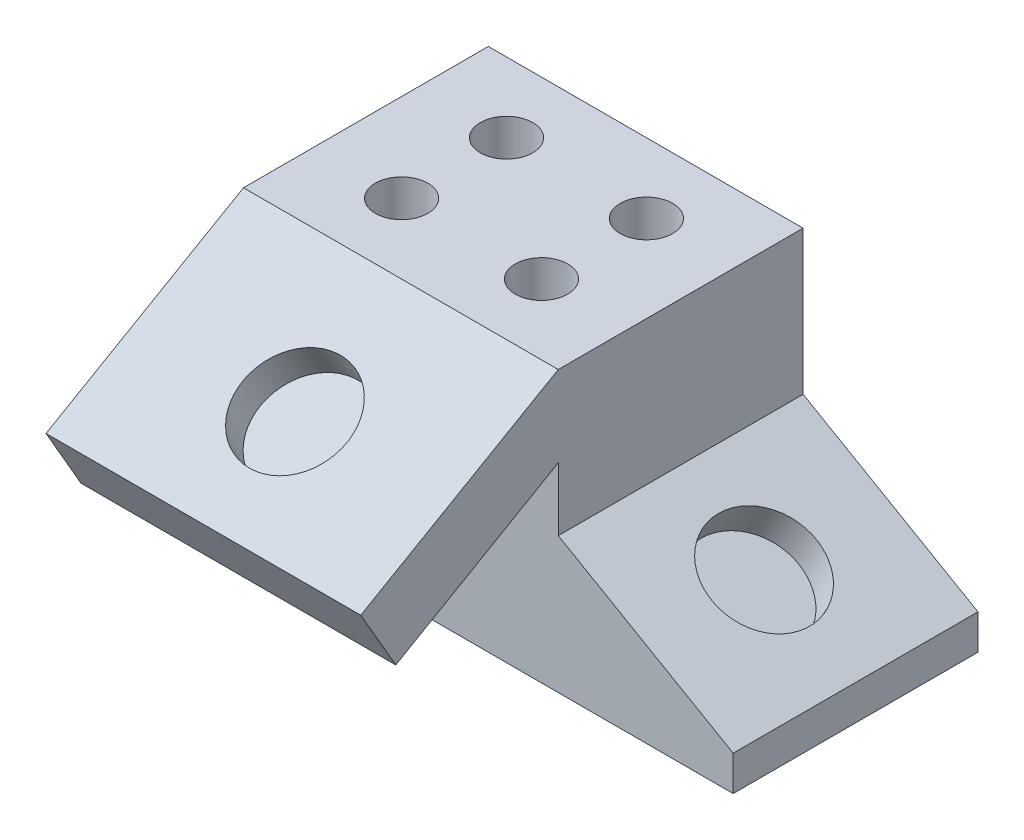
ISO-10303-21;
HEADER;
FILE_DESCRIPTION(('STEP AP214'),'2;1');
FILE_NAME('part.step','',(''),(''),'','','');
FILE_SCHEMA(('AUTOMOTIVE_DESIGN { 1 0 10303 214 1 1 1 1 }'));
ENDSEC;
DATA;
#1=APPLICATION_CONTEXT('core data for automotive mechanical design processes');
#2=APPLICATION_PROTOCOL_DEFINITION('international standard','automotive_design',2000,#1);
#3=PRODUCT_CONTEXT('',#1,'mechanical');
#4=PRODUCT('Part','Part','',(#3));
#5=PRODUCT_RELATED_PRODUCT_CATEGORY('part','',(#4));
#6=PRODUCT_DEFINITION_FORMATION('','',#4);
#7=PRODUCT_DEFINITION_CONTEXT('part definition',#1,'design');
#8=PRODUCT_DEFINITION('design','',#6,#7);
#9=PRODUCT_DEFINITION_SHAPE('','',#8);
#10=(LENGTH_UNIT() NAMED_UNIT(*) SI_UNIT(.MILLI.,.METRE.));
#11=(NAMED_UNIT(*) PLANE_ANGLE_UNIT() SI_UNIT($,.RADIAN.));
#12=(NAMED_UNIT(*) SI_UNIT($,.STERADIAN.) SOLID_ANGLE_UNIT());
#13=UNCERTAINTY_MEASURE_WITH_UNIT(LENGTH_MEASURE(1.E-05),#10,'distance_accuracy_value','');
#14=(GEOMETRIC_REPRESENTATION_CONTEXT(3) GLOBAL_UNCERTAINTY_ASSIGNED_CONTEXT((#13)) GLOBAL_UNIT_ASSIGNED_CONTEXT((#10,
#11,#12)) REPRESENTATION_CONTEXT('',''));
#15=CARTESIAN_POINT('',(0.,0.,0.));
#16=DIRECTION('',(0.,0.,1.));
#17=DIRECTION('',(1.,0.,0.));
#18=AXIS2_PLACEMENT_3D('',#15,#16,#17);
#19=CARTESIAN_POINT('',(0.,0.,0.));
#20=DIRECTION('',(0.,0.,-1.));
#21=DIRECTION('',(-1.,0.,0.));
#22=AXIS2_PLACEMENT_3D('',#19,#20,#21);
#23=PLANE('',#22);
#24=DIRECTION('',(1.,0.,0.));
#25=VECTOR('',#24,1.);
#26=CARTESIAN_POINT('',(0.,36.1353031625835,0.));
#27=LINE('',#26,#25);
#28=CARTESIAN_POINT('',(0.,36.1353031625835,0.));
#29=VERTEX_POINT('',#28);
#30=CARTESIAN_POINT('',(57.15,36.1353031625835,0.));
#31=VERTEX_POINT('',#30);
#32=EDGE_CURVE('E61',#29,#31,#27,.T.);
#33=ORIENTED_EDGE('',*,*,#32,.F.);
#34=DIRECTION('',(0.,-1.,0.));
#35=VECTOR('',#34,1.);
#36=CARTESIAN_POINT('',(0.,0.,0.));
#37=LINE('',#36,#35);
#38=CARTESIAN_POINT('',(0.,0.,0.));
#39=VERTEX_POINT('',#38);
#40=EDGE_CURVE('E150',#29,#39,#37,.T.);
#41=ORIENTED_EDGE('',*,*,#40,.T.);
#42=DIRECTION('',(1.,0.,0.));
#43=VECTOR('',#42,1.);
#44=CARTESIAN_POINT('',(57.15,0.,0.));
#45=LINE('',#44,#43);
#46=CARTESIAN_POINT('',(88.9,0.,0.));
#47=VERTEX_POINT('',#46);
#48=EDGE_CURVE('E153',#39,#47,#45,.T.);
#49=ORIENTED_EDGE('',*,*,#48,.T.);
#50=DIRECTION('',(0.,1.,0.));
#51=VECTOR('',#50,1.);
#52=CARTESIAN_POINT('',(88.9,0.,0.));
#53=LINE('',#52,#51);
#54=CARTESIAN_POINT('',(88.9,6.35,0.));
#55=VERTEX_POINT('',#54);
#56=EDGE_CURVE('E158',#47,#55,#53,.T.);
#57=ORIENTED_EDGE('',*,*,#56,.T.);
#58=DIRECTION('',(-0.86602540378444,0.499999999999998,0.));
#59=VECTOR('',#58,1.);
#60=CARTESIAN_POINT('',(88.9,6.35,0.));
#61=LINE('',#60,#59);
#62=CARTESIAN_POINT('',(57.15,24.6808710467705,0.));
#63=VERTEX_POINT('',#62);
#64=EDGE_CURVE('E162',#55,#63,#61,.T.);
#65=ORIENTED_EDGE('',*,*,#64,.T.);
#66=DIRECTION('',(0.,1.,0.));
#67=VECTOR('',#66,1.);
#68=CARTESIAN_POINT('',(57.15,24.6808710467705,0.));
#69=LINE('',#68,#67);
#70=EDGE_CURVE('E120',#63,#31,#69,.T.);
#71=ORIENTED_EDGE('',*,*,#70,.T.);
#72=EDGE_LOOP('',(#33,#41,#49,#57,#65,#71));
#73=FACE_BOUND('',#72,.T.);
#74=ADVANCED_FACE('F43',(#73),#23,.F.);
#75=CARTESIAN_POINT('',(0.,0.,-44.45));
#76=DIRECTION('',(-1.,0.,0.));
#77=DIRECTION('',(0.,0.,1.));
#78=AXIS2_PLACEMENT_3D('',#75,#76,#77);
#79=PLANE('',#78);
#80=ORIENTED_EDGE('',*,*,#40,.F.);
#81=DIRECTION('',(0.,0.500000000000002,-0.866025403784438));
#82=VECTOR('',#81,1.);
#83=CARTESIAN_POINT('',(0.,19.1004773719376,29.5051837674833));
#84=LINE('',#83,#82);
#85=CARTESIAN_POINT('',(0.,19.1004773719376,29.5051837674833));
#86=VERTEX_POINT('',#85);
#87=EDGE_CURVE('E235',#86,#29,#84,.T.);
#88=ORIENTED_EDGE('',*,*,#87,.F.);
#89=DIRECTION('',(0.,-0.866025403784438,-0.500000000000001));
#90=VECTOR('',#89,1.);
#91=CARTESIAN_POINT('',(0.,30.0989999999999,35.8551837674833));
#92=LINE('',#91,#90);
#93=CARTESIAN_POINT('',(0.,30.0989999999999,35.8551837674833));
#94=VERTEX_POINT('',#93);
#95=EDGE_CURVE('E256',#94,#86,#92,.T.);
#96=ORIENTED_EDGE('',*,*,#95,.F.);
#97=DIRECTION('',(0.,-0.500000000000001,0.866025403784438));
#98=VECTOR('',#97,1.);
#99=CARTESIAN_POINT('',(0.,50.8,0.));
#100=LINE('',#99,#98);
#101=CARTESIAN_POINT('',(0.,50.8,0.));
#102=VERTEX_POINT('',#101);
#103=EDGE_CURVE('E244',#102,#94,#100,.T.);
#104=ORIENTED_EDGE('',*,*,#103,.F.);
#105=DIRECTION('',(0.,0.,1.));
#106=VECTOR('',#105,1.);
#107=CARTESIAN_POINT('',(0.,50.8,-44.45));
#108=LINE('',#107,#106);
#109=CARTESIAN_POINT('',(0.,50.8,-44.45));
#110=VERTEX_POINT('',#109);
#111=EDGE_CURVE('E11',#110,#102,#108,.T.);
#112=ORIENTED_EDGE('',*,*,#111,.F.);
#113=DIRECTION('',(0.,-1.,0.));
#114=VECTOR('',#113,1.);
#115=CARTESIAN_POINT('',(0.,0.,-44.45));
#116=LINE('',#115,#114);
#117=CARTESIAN_POINT('',(0.,0.,-44.45));
#118=VERTEX_POINT('',#117);
#119=EDGE_CURVE('E169',#110,#118,#116,.T.);
#120=ORIENTED_EDGE('',*,*,#119,.T.);
#121=DIRECTION('',(0.,0.,1.));
#122=VECTOR('',#121,1.);
#123=CARTESIAN_POINT('',(0.,0.,-44.45));
#124=LINE('',#123,#122);
#125=EDGE_CURVE('E47',#118,#39,#124,.T.);
#126=ORIENTED_EDGE('',*,*,#125,.T.);
#127=EDGE_LOOP('',(#80,#88,#96,#104,#112,#120,#126));
#128=FACE_BOUND('',#127,.T.);
#129=ADVANCED_FACE('F45',(#128),#79,.T.);
#130=CARTESIAN_POINT('',(0.,50.8,-44.45));
#131=DIRECTION('',(0.,1.,0.));
#132=DIRECTION('',(0.,0.,1.));
#133=AXIS2_PLACEMENT_3D('',#130,#131,#132);
#134=PLANE('',#133);
#135=CARTESIAN_POINT('',(16.0019999999999,50.8,-31.75));
#136=DIRECTION('',(0.,1.,0.));
#137=DIRECTION('',(0.,0.,1.));
#138=AXIS2_PLACEMENT_3D('',#135,#136,#137);
#139=CIRCLE('',#138,4.7625);
#140=CARTESIAN_POINT('',(16.0019999999999,50.8,-26.9875));
#141=VERTEX_POINT('',#140);
#142=EDGE_CURVE('E199',#141,#141,#139,.T.);
#143=ORIENTED_EDGE('',*,*,#142,.F.);
#144=EDGE_LOOP('',(#143));
#145=FACE_BOUND('',#144,.T.);
#146=CARTESIAN_POINT('',(41.4019999999999,50.8,-31.75));
#147=DIRECTION('',(0.,1.,0.));
#148=DIRECTION('',(0.,0.,1.));
#149=AXIS2_PLACEMENT_3D('',#146,#147,#148);
#150=CIRCLE('',#149,4.7625);
#151=CARTESIAN_POINT('',(41.4019999999999,50.8,-26.9875));
#152=VERTEX_POINT('',#151);
#153=EDGE_CURVE('E208',#152,#152,#150,.T.);
#154=ORIENTED_EDGE('',*,*,#153,.F.);
#155=EDGE_LOOP('',(#154));
#156=FACE_BOUND('',#155,.T.);
#157=CARTESIAN_POINT('',(41.402,50.8,-12.7));
#158=DIRECTION('',(0.,1.,0.));
#159=DIRECTION('',(0.,0.,1.));
#160=AXIS2_PLACEMENT_3D('',#157,#158,#159);
#161=CIRCLE('',#160,4.7625);
#162=CARTESIAN_POINT('',(41.402,50.8,-7.93749999999999));
#163=VERTEX_POINT('',#162);
#164=EDGE_CURVE('E216',#163,#163,#161,.T.);
#165=ORIENTED_EDGE('',*,*,#164,.F.);
#166=EDGE_LOOP('',(#165));
#167=FACE_BOUND('',#166,.T.);
#168=CARTESIAN_POINT('',(16.002,50.8,-12.7));
#169=DIRECTION('',(0.,1.,0.));
#170=DIRECTION('',(0.,0.,1.));
#171=AXIS2_PLACEMENT_3D('',#168,#169,#170);
#172=CIRCLE('',#171,4.7625);
#173=CARTESIAN_POINT('',(16.002,50.8,-7.9375));
#174=VERTEX_POINT('',#173);
#175=EDGE_CURVE('E191',#174,#174,#172,.T.);
#176=ORIENTED_EDGE('',*,*,#175,.F.);
#177=EDGE_LOOP('',(#176));
#178=FACE_BOUND('',#177,.T.);
#179=DIRECTION('',(-1.,0.,0.));
#180=VECTOR('',#179,1.);
#181=CARTESIAN_POINT('',(0.,50.8,0.));
#182=LINE('',#181,#180);
#183=CARTESIAN_POINT('',(57.15,50.8,0.));
#184=VERTEX_POINT('',#183);
#185=EDGE_CURVE('E167',#184,#102,#182,.T.);
#186=ORIENTED_EDGE('',*,*,#185,.F.);
#187=DIRECTION('',(0.,0.,1.));
#188=VECTOR('',#187,1.);
#189=CARTESIAN_POINT('',(57.15,50.8,-44.45));
#190=LINE('',#189,#188);
#191=CARTESIAN_POINT('',(57.15,50.8,-44.45));
#192=VERTEX_POINT('',#191);
#193=EDGE_CURVE('E53',#192,#184,#190,.T.);
#194=ORIENTED_EDGE('',*,*,#193,.F.);
#195=DIRECTION('',(-1.,0.,0.));
#196=VECTOR('',#195,1.);
#197=CARTESIAN_POINT('',(0.,50.8,-44.45));
#198=LINE('',#197,#196);
#199=EDGE_CURVE('E134',#192,#110,#198,.T.);
#200=ORIENTED_EDGE('',*,*,#199,.T.);
#201=ORIENTED_EDGE('',*,*,#111,.T.);
#202=EDGE_LOOP('',(#186,#194,#200,#201));
#203=FACE_BOUND('',#202,.T.);
#204=ADVANCED_FACE('F313',(#145,#156,#167,#178,#203),#134,.T.);
#205=CARTESIAN_POINT('',(57.15,24.6808710467705,-44.45));
#206=DIRECTION('',(1.,0.,0.));
#207=DIRECTION('',(0.,0.,-1.));
#208=AXIS2_PLACEMENT_3D('',#205,#206,#207);
#209=PLANE('',#208);
#210=ORIENTED_EDGE('',*,*,#70,.F.);
#211=DIRECTION('',(0.,0.,1.));
#212=VECTOR('',#211,1.);
#213=CARTESIAN_POINT('',(57.15,24.6808710467705,-44.45));
#214=LINE('',#213,#212);
#215=CARTESIAN_POINT('',(57.15,24.6808710467705,-44.45));
#216=VERTEX_POINT('',#215);
#217=EDGE_CURVE('E114',#216,#63,#214,.T.);
#218=ORIENTED_EDGE('',*,*,#217,.F.);
#219=DIRECTION('',(0.,1.,0.));
#220=VECTOR('',#219,1.);
#221=CARTESIAN_POINT('',(57.15,24.6808710467705,-44.45));
#222=LINE('',#221,#220);
#223=EDGE_CURVE('E117',#216,#192,#222,.T.);
#224=ORIENTED_EDGE('',*,*,#223,.T.);
#225=ORIENTED_EDGE('',*,*,#193,.T.);
#226=DIRECTION('',(0.,-0.500000000000001,0.866025403784438));
#227=VECTOR('',#226,1.);
#228=CARTESIAN_POINT('',(57.15,50.8,0.));
#229=LINE('',#228,#227);
#230=CARTESIAN_POINT('',(57.15,30.0989999999999,35.8551837674833));
#231=VERTEX_POINT('',#230);
#232=EDGE_CURVE('E249',#184,#231,#229,.T.);
#233=ORIENTED_EDGE('',*,*,#232,.T.);
#234=DIRECTION('',(0.,-0.866025403784438,-0.500000000000001));
#235=VECTOR('',#234,1.);
#236=CARTESIAN_POINT('',(57.15,30.0989999999999,35.8551837674833));
#237=LINE('',#236,#235);
#238=CARTESIAN_POINT('',(57.15,19.1004773719376,29.5051837674833));
#239=VERTEX_POINT('',#238);
#240=EDGE_CURVE('E245',#231,#239,#237,.T.);
#241=ORIENTED_EDGE('',*,*,#240,.T.);
#242=DIRECTION('',(0.,0.500000000000002,-0.866025403784438));
#243=VECTOR('',#242,1.);
#244=CARTESIAN_POINT('',(57.15,19.1004773719376,29.5051837674833));
#245=LINE('',#244,#243);
#246=EDGE_CURVE('E241',#239,#31,#245,.T.);
#247=ORIENTED_EDGE('',*,*,#246,.T.);
#248=EDGE_LOOP('',(#210,#218,#224,#225,#233,#241,#247));
#249=FACE_BOUND('',#248,.T.);
#250=ADVANCED_FACE('F116',(#249),#209,.T.);
#251=CARTESIAN_POINT('',(88.9,6.35,-44.45));
#252=DIRECTION('',(0.499999999999998,0.86602540378444,0.));
#253=DIRECTION('',(-0.86602540378444,0.499999999999998,0.));
#254=AXIS2_PLACEMENT_3D('',#251,#252,#253);
#255=PLANE('',#254);
#256=CARTESIAN_POINT('',(72.4022160579064,15.875,-22.098));
#257=DIRECTION('',(0.499999999999998,0.86602540378444,0.));
#258=DIRECTION('',(-0.86602540378444,0.499999999999998,0.));
#259=AXIS2_PLACEMENT_3D('',#256,#257,#258);
#260=CIRCLE('',#259,9.52500000000001);
#261=CARTESIAN_POINT('',(64.1533240868596,20.6374999999999,-22.098));
#262=VERTEX_POINT('',#261);
#263=EDGE_CURVE('E223',#262,#262,#260,.T.);
#264=ORIENTED_EDGE('',*,*,#263,.F.);
#265=EDGE_LOOP('',(#264));
#266=FACE_BOUND('',#265,.T.);
#267=ORIENTED_EDGE('',*,*,#64,.F.);
#268=DIRECTION('',(0.,0.,1.));
#269=VECTOR('',#268,1.);
#270=CARTESIAN_POINT('',(88.9,6.35,-44.45));
#271=LINE('',#270,#269);
#272=CARTESIAN_POINT('',(88.9,6.35,-44.45));
#273=VERTEX_POINT('',#272);
#274=EDGE_CURVE('E126',#273,#55,#271,.T.);
#275=ORIENTED_EDGE('',*,*,#274,.F.);
#276=DIRECTION('',(-0.86602540378444,0.499999999999998,0.));
#277=VECTOR('',#276,1.);
#278=CARTESIAN_POINT('',(88.9,6.35,-44.45));
#279=LINE('',#278,#277);
#280=EDGE_CURVE('E132',#273,#216,#279,.T.);
#281=ORIENTED_EDGE('',*,*,#280,.T.);
#282=ORIENTED_EDGE('',*,*,#217,.T.);
#283=EDGE_LOOP('',(#267,#275,#281,#282));
#284=FACE_BOUND('',#283,.T.);
#285=ADVANCED_FACE('F137',(#266,#284),#255,.T.);
#286=CARTESIAN_POINT('',(88.9,0.,-44.45));
#287=DIRECTION('',(1.,0.,0.));
#288=DIRECTION('',(0.,0.,-1.));
#289=AXIS2_PLACEMENT_3D('',#286,#287,#288);
#290=PLANE('',#289);
#291=ORIENTED_EDGE('',*,*,#56,.F.);
#292=DIRECTION('',(0.,0.,1.));
#293=VECTOR('',#292,1.);
#294=CARTESIAN_POINT('',(88.9,0.,-44.45));
#295=LINE('',#294,#293);
#296=CARTESIAN_POINT('',(88.9,0.,-44.45));
#297=VERTEX_POINT('',#296);
#298=EDGE_CURVE('E174',#297,#47,#295,.T.);
#299=ORIENTED_EDGE('',*,*,#298,.F.);
#300=DIRECTION('',(0.,1.,0.));
#301=VECTOR('',#300,1.);
#302=CARTESIAN_POINT('',(88.9,0.,-44.45));
#303=LINE('',#302,#301);
#304=EDGE_CURVE('E139',#297,#273,#303,.T.);
#305=ORIENTED_EDGE('',*,*,#304,.T.);
#306=ORIENTED_EDGE('',*,*,#274,.T.);
#307=EDGE_LOOP('',(#291,#299,#305,#306));
#308=FACE_BOUND('',#307,.T.);
#309=ADVANCED_FACE('F324',(#308),#290,.T.);
#310=CARTESIAN_POINT('',(57.15,0.,-44.45));
#311=DIRECTION('',(0.,-1.,0.));
#312=DIRECTION('',(0.,0.,-1.));
#313=AXIS2_PLACEMENT_3D('',#310,#311,#312);
#314=PLANE('',#313);
#315=ORIENTED_EDGE('',*,*,#48,.F.);
#316=ORIENTED_EDGE('',*,*,#125,.F.);
#317=DIRECTION('',(1.,0.,0.));
#318=VECTOR('',#317,1.);
#319=CARTESIAN_POINT('',(0.,0.,-44.45));
#320=LINE('',#319,#318);
#321=EDGE_CURVE('E144',#118,#297,#320,.T.);
#322=ORIENTED_EDGE('',*,*,#321,.T.);
#323=ORIENTED_EDGE('',*,*,#298,.T.);
#324=EDGE_LOOP('',(#315,#316,#322,#323));
#325=FACE_BOUND('',#324,.T.);
#326=ADVANCED_FACE('F327',(#325),#314,.T.);
#327=CARTESIAN_POINT('',(0.,0.,-44.45));
#328=DIRECTION('',(0.,0.,-1.));
#329=DIRECTION('',(-1.,0.,0.));
#330=AXIS2_PLACEMENT_3D('',#327,#328,#329);
#331=PLANE('',#330);
#332=ORIENTED_EDGE('',*,*,#119,.F.);
#333=ORIENTED_EDGE('',*,*,#199,.F.);
#334=ORIENTED_EDGE('',*,*,#223,.F.);
#335=ORIENTED_EDGE('',*,*,#280,.F.);
#336=ORIENTED_EDGE('',*,*,#304,.F.);
#337=ORIENTED_EDGE('',*,*,#321,.F.);
#338=EDGE_LOOP('',(#332,#333,#334,#335,#336,#337));
#339=FACE_BOUND('',#338,.T.);
#340=ADVANCED_FACE('F130',(#339),#331,.T.);
#341=CARTESIAN_POINT('',(16.002,38.1,-12.7));
#342=DIRECTION('',(0.,1.,0.));
#343=DIRECTION('',(0.,0.,1.));
#344=AXIS2_PLACEMENT_3D('',#341,#342,#343);
#345=CYLINDRICAL_SURFACE('',#344,4.7625);
#346=CARTESIAN_POINT('',(16.002,38.1,-12.7));
#347=DIRECTION('',(0.,1.,0.));
#348=DIRECTION('',(0.,0.,1.));
#349=AXIS2_PLACEMENT_3D('',#346,#347,#348);
#350=CIRCLE('',#349,4.7625);
#351=CARTESIAN_POINT('',(16.002,38.1,-7.9375));
#352=VERTEX_POINT('',#351);
#353=EDGE_CURVE('E154',#352,#352,#350,.T.);
#354=ORIENTED_EDGE('',*,*,#353,.F.);
#355=EDGE_LOOP('',(#354));
#356=FACE_BOUND('',#355,.T.);
#357=ORIENTED_EDGE('',*,*,#175,.T.);
#358=EDGE_LOOP('',(#357));
#359=FACE_BOUND('',#358,.T.);
#360=ADVANCED_FACE('F333',(#356,#359),#345,.F.);
#361=CARTESIAN_POINT('',(16.002,38.1,-12.7));
#362=DIRECTION('',(0.,1.,0.));
#363=DIRECTION('',(0.,0.,1.));
#364=AXIS2_PLACEMENT_3D('',#361,#362,#363);
#365=PLANE('',#364);
#366=ORIENTED_EDGE('',*,*,#353,.T.);
#367=EDGE_LOOP('',(#366));
#368=FACE_BOUND('',#367,.T.);
#369=ADVANCED_FACE('F337',(#368),#365,.T.);
#370=CARTESIAN_POINT('',(41.402,38.1,-12.7));
#371=DIRECTION('',(0.,1.,0.));
#372=DIRECTION('',(0.,0.,1.));
#373=AXIS2_PLACEMENT_3D('',#370,#371,#372);
#374=CYLINDRICAL_SURFACE('',#373,4.7625);
#375=CARTESIAN_POINT('',(41.402,38.1,-12.7));
#376=DIRECTION('',(0.,1.,0.));
#377=DIRECTION('',(0.,0.,1.));
#378=AXIS2_PLACEMENT_3D('',#375,#376,#377);
#379=CIRCLE('',#378,4.7625);
#380=CARTESIAN_POINT('',(41.402,38.1,-7.93749999999999));
#381=VERTEX_POINT('',#380);
#382=EDGE_CURVE('E195',#381,#381,#379,.T.);
#383=ORIENTED_EDGE('',*,*,#382,.F.);
#384=EDGE_LOOP('',(#383));
#385=FACE_BOUND('',#384,.T.);
#386=ORIENTED_EDGE('',*,*,#164,.T.);
#387=EDGE_LOOP('',(#386));
#388=FACE_BOUND('',#387,.T.);
#389=ADVANCED_FACE('F342',(#385,#388),#374,.F.);
#390=CARTESIAN_POINT('',(41.402,38.1,-12.7));
#391=DIRECTION('',(0.,1.,0.));
#392=DIRECTION('',(0.,0.,1.));
#393=AXIS2_PLACEMENT_3D('',#390,#391,#392);
#394=PLANE('',#393);
#395=ORIENTED_EDGE('',*,*,#382,.T.);
#396=EDGE_LOOP('',(#395));
#397=FACE_BOUND('',#396,.T.);
#398=ADVANCED_FACE('F361',(#397),#394,.T.);
#399=CARTESIAN_POINT('',(41.4019999999999,38.1,-31.75));
#400=DIRECTION('',(0.,1.,0.));
#401=DIRECTION('',(0.,0.,1.));
#402=AXIS2_PLACEMENT_3D('',#399,#400,#401);
#403=CYLINDRICAL_SURFACE('',#402,4.7625);
#404=CARTESIAN_POINT('',(41.4019999999999,38.1,-31.75));
#405=DIRECTION('',(0.,1.,0.));
#406=DIRECTION('',(0.,0.,1.));
#407=AXIS2_PLACEMENT_3D('',#404,#405,#406);
#408=CIRCLE('',#407,4.7625);
#409=CARTESIAN_POINT('',(41.4019999999999,38.1,-26.9875));
#410=VERTEX_POINT('',#409);
#411=EDGE_CURVE('E212',#410,#410,#408,.T.);
#412=ORIENTED_EDGE('',*,*,#411,.F.);
#413=EDGE_LOOP('',(#412));
#414=FACE_BOUND('',#413,.T.);
#415=ORIENTED_EDGE('',*,*,#153,.T.);
#416=EDGE_LOOP('',(#415));
#417=FACE_BOUND('',#416,.T.);
#418=ADVANCED_FACE('F358',(#414,#417),#403,.F.);
#419=CARTESIAN_POINT('',(41.4019999999999,38.1,-31.75));
#420=DIRECTION('',(0.,1.,0.));
#421=DIRECTION('',(0.,0.,1.));
#422=AXIS2_PLACEMENT_3D('',#419,#420,#421);
#423=PLANE('',#422);
#424=ORIENTED_EDGE('',*,*,#411,.T.);
#425=EDGE_LOOP('',(#424));
#426=FACE_BOUND('',#425,.T.);
#427=ADVANCED_FACE('F352',(#426),#423,.T.);
#428=CARTESIAN_POINT('',(16.0019999999999,38.1,-31.75));
#429=DIRECTION('',(0.,1.,0.));
#430=DIRECTION('',(0.,0.,1.));
#431=AXIS2_PLACEMENT_3D('',#428,#429,#430);
#432=CYLINDRICAL_SURFACE('',#431,4.7625);
#433=CARTESIAN_POINT('',(16.0019999999999,38.1,-31.75));
#434=DIRECTION('',(0.,1.,0.));
#435=DIRECTION('',(0.,0.,1.));
#436=AXIS2_PLACEMENT_3D('',#433,#434,#435);
#437=CIRCLE('',#436,4.7625);
#438=CARTESIAN_POINT('',(16.0019999999999,38.1,-26.9875));
#439=VERTEX_POINT('',#438);
#440=EDGE_CURVE('E203',#439,#439,#437,.T.);
#441=ORIENTED_EDGE('',*,*,#440,.F.);
#442=EDGE_LOOP('',(#441));
#443=FACE_BOUND('',#442,.T.);
#444=ORIENTED_EDGE('',*,*,#142,.T.);
#445=EDGE_LOOP('',(#444));
#446=FACE_BOUND('',#445,.T.);
#447=ADVANCED_FACE('F348',(#443,#446),#432,.F.);
#448=CARTESIAN_POINT('',(16.0019999999999,38.1,-31.75));
#449=DIRECTION('',(0.,1.,0.));
#450=DIRECTION('',(0.,0.,1.));
#451=AXIS2_PLACEMENT_3D('',#448,#449,#450);
#452=PLANE('',#451);
#453=ORIENTED_EDGE('',*,*,#440,.T.);
#454=EDGE_LOOP('',(#453));
#455=FACE_BOUND('',#454,.T.);
#456=ADVANCED_FACE('F351',(#455),#452,.T.);
#457=CARTESIAN_POINT('',(69.2272160579065,10.3757386859688,-22.098));
#458=DIRECTION('',(0.499999999999998,0.86602540378444,0.));
#459=DIRECTION('',(-0.86602540378444,0.499999999999998,0.));
#460=AXIS2_PLACEMENT_3D('',#457,#458,#459);
#461=CYLINDRICAL_SURFACE('',#460,9.52500000000001);
#462=CARTESIAN_POINT('',(69.2272160579065,10.3757386859688,-22.098));
#463=DIRECTION('',(0.499999999999998,0.86602540378444,0.));
#464=DIRECTION('',(-0.86602540378444,0.499999999999998,0.));
#465=AXIS2_PLACEMENT_3D('',#462,#463,#464);
#466=CIRCLE('',#465,9.52500000000001);
#467=CARTESIAN_POINT('',(60.9783240868597,15.1382386859687,-22.098));
#468=VERTEX_POINT('',#467);
#469=EDGE_CURVE('E204',#468,#468,#466,.T.);
#470=ORIENTED_EDGE('',*,*,#469,.F.);
#471=EDGE_LOOP('',(#470));
#472=FACE_BOUND('',#471,.T.);
#473=ORIENTED_EDGE('',*,*,#263,.T.);
#474=EDGE_LOOP('',(#473));
#475=FACE_BOUND('',#474,.T.);
#476=ADVANCED_FACE('F356',(#472,#475),#461,.F.);
#477=CARTESIAN_POINT('',(69.2272160579065,10.3757386859688,-22.098));
#478=DIRECTION('',(0.499999999999998,0.86602540378444,0.));
#479=DIRECTION('',(-0.86602540378444,0.499999999999998,0.));
#480=AXIS2_PLACEMENT_3D('',#477,#478,#479);
#481=PLANE('',#480);
#482=ORIENTED_EDGE('',*,*,#469,.T.);
#483=EDGE_LOOP('',(#482));
#484=FACE_BOUND('',#483,.T.);
#485=ADVANCED_FACE('F306',(#484),#481,.T.);
#486=CARTESIAN_POINT('',(0.,19.1004773719376,29.5051837674833));
#487=DIRECTION('',(0.,-0.866025403784438,-0.500000000000002));
#488=DIRECTION('',(0.,0.500000000000002,-0.866025403784438));
#489=AXIS2_PLACEMENT_3D('',#486,#487,#488);
#490=PLANE('',#489);
#491=ORIENTED_EDGE('',*,*,#246,.F.);
#492=DIRECTION('',(1.,0.,0.));
#493=VECTOR('',#492,1.);
#494=CARTESIAN_POINT('',(0.,19.1004773719376,29.5051837674833));
#495=LINE('',#494,#493);
#496=EDGE_CURVE('E234',#86,#239,#495,.T.);
#497=ORIENTED_EDGE('',*,*,#496,.F.);
#498=ORIENTED_EDGE('',*,*,#87,.T.);
#499=ORIENTED_EDGE('',*,*,#32,.T.);
#500=EDGE_LOOP('',(#491,#497,#498,#499));
#501=FACE_BOUND('',#500,.T.);
#502=ADVANCED_FACE('F300',(#501),#490,.T.);
#503=CARTESIAN_POINT('',(0.,30.0989999999999,35.8551837674833));
#504=DIRECTION('',(0.,-0.500000000000002,0.866025403784438));
#505=DIRECTION('',(0.,-0.866025403784438,-0.500000000000002));
#506=AXIS2_PLACEMENT_3D('',#503,#504,#505);
#507=PLANE('',#506);
#508=ORIENTED_EDGE('',*,*,#240,.F.);
#509=DIRECTION('',(1.,0.,0.));
#510=VECTOR('',#509,1.);
#511=CARTESIAN_POINT('',(0.,30.0989999999999,35.8551837674833));
#512=LINE('',#511,#510);
#513=EDGE_CURVE('E230',#94,#231,#512,.T.);
#514=ORIENTED_EDGE('',*,*,#513,.F.);
#515=ORIENTED_EDGE('',*,*,#95,.T.);
#516=ORIENTED_EDGE('',*,*,#496,.T.);
#517=EDGE_LOOP('',(#508,#514,#515,#516));
#518=FACE_BOUND('',#517,.T.);
#519=ADVANCED_FACE('F284',(#518),#507,.T.);
#520=CARTESIAN_POINT('',(0.,50.8,0.));
#521=DIRECTION('',(0.,0.866025403784438,0.500000000000001));
#522=DIRECTION('',(0.,-0.500000000000001,0.866025403784438));
#523=AXIS2_PLACEMENT_3D('',#520,#521,#522);
#524=PLANE('',#523);
#525=CARTESIAN_POINT('',(28.702,39.624,19.3573998253898));
#526=DIRECTION('',(0.,0.866025403784438,0.500000000000001));
#527=DIRECTION('',(0.,-0.500000000000001,0.866025403784438));
#528=AXIS2_PLACEMENT_3D('',#525,#526,#527);
#529=CIRCLE('',#528,9.525);
#530=CARTESIAN_POINT('',(28.702,34.8615,27.6062917964365));
#531=VERTEX_POINT('',#530);
#532=EDGE_CURVE('E263',#531,#531,#529,.T.);
#533=ORIENTED_EDGE('',*,*,#532,.F.);
#534=EDGE_LOOP('',(#533));
#535=FACE_BOUND('',#534,.T.);
#536=ORIENTED_EDGE('',*,*,#232,.F.);
#537=ORIENTED_EDGE('',*,*,#185,.T.);
#538=ORIENTED_EDGE('',*,*,#103,.T.);
#539=ORIENTED_EDGE('',*,*,#513,.T.);
#540=EDGE_LOOP('',(#536,#537,#538,#539));
#541=FACE_BOUND('',#540,.T.);
#542=ADVANCED_FACE('F278',(#535,#541),#524,.T.);
#543=CARTESIAN_POINT('',(28.702,34.1247386859688,16.1823998253897));
#544=DIRECTION('',(0.,0.866025403784438,0.500000000000001));
#545=DIRECTION('',(0.,-0.500000000000001,0.866025403784438));
#546=AXIS2_PLACEMENT_3D('',#543,#544,#545);
#547=CYLINDRICAL_SURFACE('',#546,9.525);
#548=CARTESIAN_POINT('',(28.702,34.1247386859688,16.1823998253897));
#549=DIRECTION('',(0.,0.866025403784438,0.500000000000001));
#550=DIRECTION('',(0.,-0.500000000000001,0.866025403784438));
#551=AXIS2_PLACEMENT_3D('',#548,#549,#550);
#552=CIRCLE('',#551,9.525);
#553=CARTESIAN_POINT('',(28.702,29.3622386859688,24.4312917964365));
#554=VERTEX_POINT('',#553);
#555=EDGE_CURVE('E253',#554,#554,#552,.T.);
#556=ORIENTED_EDGE('',*,*,#555,.F.);
#557=EDGE_LOOP('',(#556));
#558=FACE_BOUND('',#557,.T.);
#559=ORIENTED_EDGE('',*,*,#532,.T.);
#560=EDGE_LOOP('',(#559));
#561=FACE_BOUND('',#560,.T.);
#562=ADVANCED_FACE('F275',(#558,#561),#547,.F.);
#563=CARTESIAN_POINT('',(28.702,34.1247386859688,16.1823998253897));
#564=DIRECTION('',(0.,0.866025403784438,0.500000000000001));
#565=DIRECTION('',(0.,-0.500000000000001,0.866025403784438));
#566=AXIS2_PLACEMENT_3D('',#563,#564,#565);
#567=PLANE('',#566);
#568=ORIENTED_EDGE('',*,*,#555,.T.);
#569=EDGE_LOOP('',(#568));
#570=FACE_BOUND('',#569,.T.);
#571=ADVANCED_FACE('F273',(#570),#567,.T.);
#572=CLOSED_SHELL('',(#74,#129,#204,#250,#285,#309,#326,#340,#360,#369,#389,#398,#418,#427,#447,
#456,#476,#485,#502,#519,#542,#562,#571));
#573=MANIFOLD_SOLID_BREP('B2',#572);
#574=ADVANCED_BREP_SHAPE_REPRESENTATION('',(#18,#573),#14);
#575=SHAPE_DEFINITION_REPRESENTATION(#9,#574);
ENDSEC;
END-ISO-10303-21;
